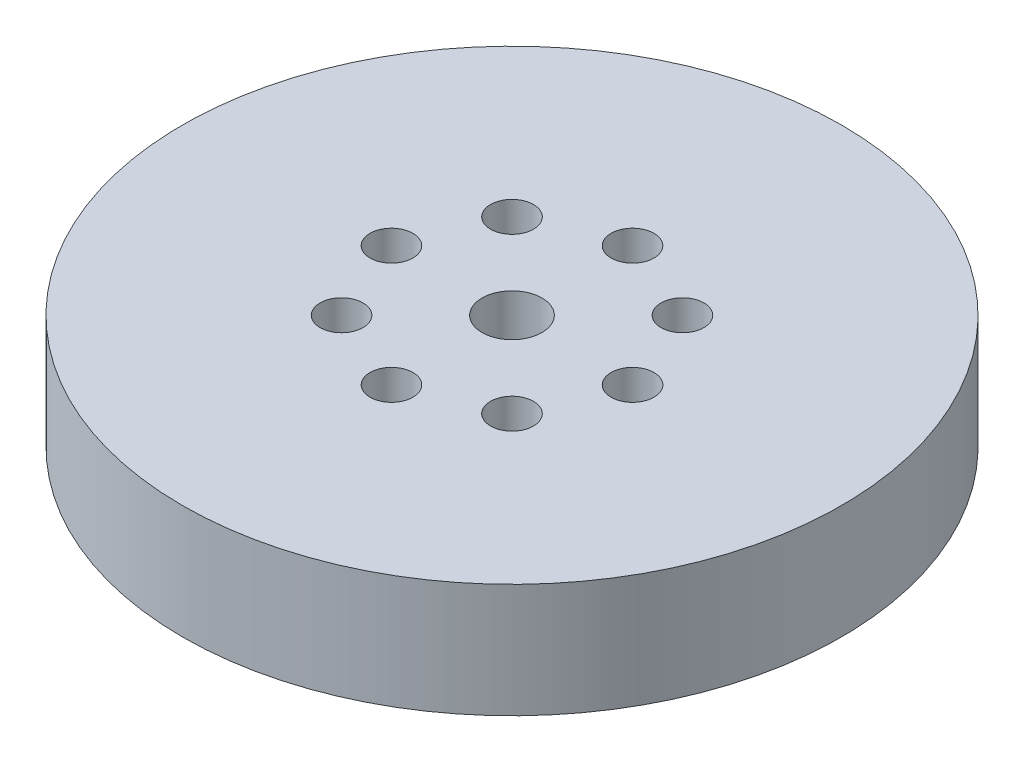
ISO-10303-21;
HEADER;
FILE_DESCRIPTION(('STEP AP214'),'2;1');
FILE_NAME('part.step','',(''),(''),'','','');
FILE_SCHEMA(('AUTOMOTIVE_DESIGN { 1 0 10303 214 1 1 1 1 }'));
ENDSEC;
DATA;
#1=APPLICATION_CONTEXT('core data for automotive mechanical design processes');
#2=APPLICATION_PROTOCOL_DEFINITION('international standard','automotive_design',2000,#1);
#3=PRODUCT_CONTEXT('',#1,'mechanical');
#4=PRODUCT('Part','Part','',(#3));
#5=PRODUCT_RELATED_PRODUCT_CATEGORY('part','',(#4));
#6=PRODUCT_DEFINITION_FORMATION('','',#4);
#7=PRODUCT_DEFINITION_CONTEXT('part definition',#1,'design');
#8=PRODUCT_DEFINITION('design','',#6,#7);
#9=PRODUCT_DEFINITION_SHAPE('','',#8);
#10=(LENGTH_UNIT() NAMED_UNIT(*) SI_UNIT(.MILLI.,.METRE.));
#11=(NAMED_UNIT(*) PLANE_ANGLE_UNIT() SI_UNIT($,.RADIAN.));
#12=(NAMED_UNIT(*) SI_UNIT($,.STERADIAN.) SOLID_ANGLE_UNIT());
#13=UNCERTAINTY_MEASURE_WITH_UNIT(LENGTH_MEASURE(1.E-05),#10,'distance_accuracy_value','');
#14=(GEOMETRIC_REPRESENTATION_CONTEXT(3) GLOBAL_UNCERTAINTY_ASSIGNED_CONTEXT((#13)) GLOBAL_UNIT_ASSIGNED_CONTEXT((#10,
#11,#12)) REPRESENTATION_CONTEXT('',''));
#15=CARTESIAN_POINT('',(0.,0.,0.));
#16=DIRECTION('',(0.,0.,1.));
#17=DIRECTION('',(1.,0.,0.));
#18=AXIS2_PLACEMENT_3D('',#15,#16,#17);
#19=CARTESIAN_POINT('',(0.,19.,0.));
#20=DIRECTION('',(0.,-1.,0.));
#21=DIRECTION('',(0.,0.,-1.));
#22=AXIS2_PLACEMENT_3D('',#19,#20,#21);
#23=CYLINDRICAL_SURFACE('',#22,55.);
#24=CARTESIAN_POINT('',(0.,19.,0.));
#25=DIRECTION('',(0.,1.,0.));
#26=DIRECTION('',(0.,0.,1.));
#27=AXIS2_PLACEMENT_3D('',#24,#25,#26);
#28=CIRCLE('',#27,55.);
#29=CARTESIAN_POINT('',(0.,19.,55.));
#30=VERTEX_POINT('',#29);
#31=EDGE_CURVE('E10',#30,#30,#28,.T.);
#32=ORIENTED_EDGE('',*,*,#31,.F.);
#33=EDGE_LOOP('',(#32));
#34=FACE_BOUND('',#33,.T.);
#35=CARTESIAN_POINT('',(0.,0.,0.));
#36=DIRECTION('',(0.,1.,0.));
#37=DIRECTION('',(0.,0.,1.));
#38=AXIS2_PLACEMENT_3D('',#35,#36,#37);
#39=CIRCLE('',#38,55.);
#40=CARTESIAN_POINT('',(0.,0.,55.));
#41=VERTEX_POINT('',#40);
#42=EDGE_CURVE('E37',#41,#41,#39,.T.);
#43=ORIENTED_EDGE('',*,*,#42,.T.);
#44=EDGE_LOOP('',(#43));
#45=FACE_BOUND('',#44,.T.);
#46=ADVANCED_FACE('F40',(#34,#45),#23,.T.);
#47=CARTESIAN_POINT('',(0.,19.,0.));
#48=DIRECTION('',(0.,1.,0.));
#49=DIRECTION('',(0.,0.,1.));
#50=AXIS2_PLACEMENT_3D('',#47,#48,#49);
#51=PLANE('',#50);
#52=CARTESIAN_POINT('',(0.,19.,20.1163164145949));
#53=DIRECTION('',(0.,1.,0.));
#54=DIRECTION('',(1.,0.,0.));
#55=AXIS2_PLACEMENT_3D('',#52,#53,#54);
#56=CIRCLE('',#55,3.57820653908378);
#57=CARTESIAN_POINT('',(3.57820653908385,19.,20.1163164145949));
#58=VERTEX_POINT('',#57);
#59=EDGE_CURVE('E88',#58,#58,#56,.T.);
#60=ORIENTED_EDGE('',*,*,#59,.F.);
#61=EDGE_LOOP('',(#60));
#62=FACE_BOUND('',#61,.T.);
#63=CARTESIAN_POINT('',(14.2243837492544,19.,14.2243837492542));
#64=DIRECTION('',(0.,1.,0.));
#65=DIRECTION('',(0.707106781186544,0.,-0.707106781186551));
#66=AXIS2_PLACEMENT_3D('',#63,#64,#65);
#67=CIRCLE('',#66,3.57820653908378);
#68=CARTESIAN_POINT('',(16.7545578575265,19.,11.694209640982));
#69=VERTEX_POINT('',#68);
#70=EDGE_CURVE('E79',#69,#69,#67,.T.);
#71=ORIENTED_EDGE('',*,*,#70,.F.);
#72=EDGE_LOOP('',(#71));
#73=FACE_BOUND('',#72,.T.);
#74=CARTESIAN_POINT('',(20.1163164145949,19.,0.));
#75=DIRECTION('',(0.,1.,0.));
#76=DIRECTION('',(0.,0.,-1.));
#77=AXIS2_PLACEMENT_3D('',#74,#75,#76);
#78=CIRCLE('',#77,3.57820653908378);
#79=CARTESIAN_POINT('',(20.1163164145949,19.,-3.57820653908378));
#80=VERTEX_POINT('',#79);
#81=EDGE_CURVE('E74',#80,#80,#78,.T.);
#82=ORIENTED_EDGE('',*,*,#81,.F.);
#83=EDGE_LOOP('',(#82));
#84=FACE_BOUND('',#83,.T.);
#85=CARTESIAN_POINT('',(14.2243837492542,19.,-14.2243837492544));
#86=DIRECTION('',(0.,1.,0.));
#87=DIRECTION('',(-0.707106781186554,0.,-0.707106781186541));
#88=AXIS2_PLACEMENT_3D('',#85,#86,#87);
#89=CIRCLE('',#88,3.57820653908378);
#90=CARTESIAN_POINT('',(11.694209640982,19.,-16.7545578575266));
#91=VERTEX_POINT('',#90);
#92=EDGE_CURVE('E70',#91,#91,#89,.T.);
#93=ORIENTED_EDGE('',*,*,#92,.F.);
#94=EDGE_LOOP('',(#93));
#95=FACE_BOUND('',#94,.T.);
#96=CARTESIAN_POINT('',(-2.10707230103466E-13,19.,-20.1163164145949));
#97=DIRECTION('',(0.,1.,0.));
#98=DIRECTION('',(-1.,0.,0.));
#99=AXIS2_PLACEMENT_3D('',#96,#97,#98);
#100=CIRCLE('',#99,3.57820653908378);
#101=CARTESIAN_POINT('',(-3.57820653908399,19.,-20.1163164145948));
#102=VERTEX_POINT('',#101);
#103=EDGE_CURVE('E100',#102,#102,#100,.T.);
#104=ORIENTED_EDGE('',*,*,#103,.F.);
#105=EDGE_LOOP('',(#104));
#106=FACE_BOUND('',#105,.T.);
#107=CARTESIAN_POINT('',(-14.2243837492545,19.,-14.2243837492541));
#108=DIRECTION('',(0.,1.,0.));
#109=DIRECTION('',(-0.707106781186539,0.,0.707106781186556));
#110=AXIS2_PLACEMENT_3D('',#107,#108,#109);
#111=CIRCLE('',#110,3.57820653908378);
#112=CARTESIAN_POINT('',(-16.7545578575266,19.,-11.6942096409819));
#113=VERTEX_POINT('',#112);
#114=EDGE_CURVE('E93',#113,#113,#111,.T.);
#115=ORIENTED_EDGE('',*,*,#114,.F.);
#116=EDGE_LOOP('',(#115));
#117=FACE_BOUND('',#116,.T.);
#118=CARTESIAN_POINT('',(-14.2243837492543,19.,14.2243837492543));
#119=DIRECTION('',(0.,1.,0.));
#120=DIRECTION('',(0.707106781186549,0.,0.707106781186546));
#121=AXIS2_PLACEMENT_3D('',#118,#119,#120);
#122=CIRCLE('',#121,3.57820653908378);
#123=CARTESIAN_POINT('',(-11.6942096409821,19.,16.7545578575265));
#124=VERTEX_POINT('',#123);
#125=EDGE_CURVE('E61',#124,#124,#122,.T.);
#126=ORIENTED_EDGE('',*,*,#125,.F.);
#127=EDGE_LOOP('',(#126));
#128=FACE_BOUND('',#127,.T.);
#129=CARTESIAN_POINT('',(-20.1163164145949,19.,0.));
#130=DIRECTION('',(0.,1.,0.));
#131=DIRECTION('',(0.,0.,1.));
#132=AXIS2_PLACEMENT_3D('',#129,#130,#131);
#133=CIRCLE('',#132,3.57820653908378);
#134=CARTESIAN_POINT('',(-20.1163164145949,19.,3.57820653908378));
#135=VERTEX_POINT('',#134);
#136=EDGE_CURVE('E54',#135,#135,#133,.T.);
#137=ORIENTED_EDGE('',*,*,#136,.F.);
#138=EDGE_LOOP('',(#137));
#139=FACE_BOUND('',#138,.T.);
#140=CARTESIAN_POINT('',(0.,19.,0.));
#141=DIRECTION('',(0.,1.,0.));
#142=DIRECTION('',(0.,0.,1.));
#143=AXIS2_PLACEMENT_3D('',#140,#141,#142);
#144=CIRCLE('',#143,5.);
#145=CARTESIAN_POINT('',(0.,19.,5.));
#146=VERTEX_POINT('',#145);
#147=EDGE_CURVE('E50',#146,#146,#144,.T.);
#148=ORIENTED_EDGE('',*,*,#147,.F.);
#149=EDGE_LOOP('',(#148));
#150=FACE_BOUND('',#149,.T.);
#151=ORIENTED_EDGE('',*,*,#31,.T.);
#152=EDGE_LOOP('',(#151));
#153=FACE_BOUND('',#152,.T.);
#154=ADVANCED_FACE('F115',(#62,#73,#84,#95,#106,#117,#128,#139,#150,#153),#51,.T.);
#155=CARTESIAN_POINT('',(0.,0.,0.));
#156=DIRECTION('',(0.,1.,0.));
#157=DIRECTION('',(0.,0.,1.));
#158=AXIS2_PLACEMENT_3D('',#155,#156,#157);
#159=PLANE('',#158);
#160=CARTESIAN_POINT('',(0.,0.,0.));
#161=DIRECTION('',(0.,1.,0.));
#162=DIRECTION('',(0.,0.,1.));
#163=AXIS2_PLACEMENT_3D('',#160,#161,#162);
#164=CIRCLE('',#163,5.);
#165=CARTESIAN_POINT('',(0.,0.,5.));
#166=VERTEX_POINT('',#165);
#167=EDGE_CURVE('E47',#166,#166,#164,.T.);
#168=ORIENTED_EDGE('',*,*,#167,.T.);
#169=EDGE_LOOP('',(#168));
#170=FACE_BOUND('',#169,.T.);
#171=ORIENTED_EDGE('',*,*,#42,.F.);
#172=EDGE_LOOP('',(#171));
#173=FACE_BOUND('',#172,.T.);
#174=ADVANCED_FACE('F113',(#170,#173),#159,.F.);
#175=CARTESIAN_POINT('',(0.,19.,0.));
#176=DIRECTION('',(0.,-1.,0.));
#177=DIRECTION('',(0.,0.,-1.));
#178=AXIS2_PLACEMENT_3D('',#175,#176,#177);
#179=CYLINDRICAL_SURFACE('',#178,5.);
#180=ORIENTED_EDGE('',*,*,#147,.T.);
#181=EDGE_LOOP('',(#180));
#182=FACE_BOUND('',#181,.T.);
#183=ORIENTED_EDGE('',*,*,#167,.F.);
#184=EDGE_LOOP('',(#183));
#185=FACE_BOUND('',#184,.T.);
#186=ADVANCED_FACE('F127',(#182,#185),#179,.F.);
#187=CARTESIAN_POINT('',(-20.1163164145949,0.740613970869972,0.));
#188=DIRECTION('',(0.,1.,0.));
#189=DIRECTION('',(0.,0.,1.));
#190=AXIS2_PLACEMENT_3D('',#187,#188,#189);
#191=CYLINDRICAL_SURFACE('',#190,3.57820653908378);
#192=CARTESIAN_POINT('',(-20.1163164145949,0.740613970869972,0.));
#193=DIRECTION('',(0.,1.,0.));
#194=DIRECTION('',(0.,0.,1.));
#195=AXIS2_PLACEMENT_3D('',#192,#193,#194);
#196=CIRCLE('',#195,3.57820653908378);
#197=CARTESIAN_POINT('',(-20.1163164145949,0.740613970869972,3.57820653908378));
#198=VERTEX_POINT('',#197);
#199=EDGE_CURVE('E55',#198,#198,#196,.T.);
#200=ORIENTED_EDGE('',*,*,#199,.F.);
#201=EDGE_LOOP('',(#200));
#202=FACE_BOUND('',#201,.T.);
#203=ORIENTED_EDGE('',*,*,#136,.T.);
#204=EDGE_LOOP('',(#203));
#205=FACE_BOUND('',#204,.T.);
#206=ADVANCED_FACE('F129',(#202,#205),#191,.F.);
#207=CARTESIAN_POINT('',(-20.1163164145949,0.740613970869972,0.));
#208=DIRECTION('',(0.,1.,0.));
#209=DIRECTION('',(0.,0.,1.));
#210=AXIS2_PLACEMENT_3D('',#207,#208,#209);
#211=PLANE('',#210);
#212=ORIENTED_EDGE('',*,*,#199,.T.);
#213=EDGE_LOOP('',(#212));
#214=FACE_BOUND('',#213,.T.);
#215=ADVANCED_FACE('F157',(#214),#211,.T.);
#216=CARTESIAN_POINT('',(-14.2243837492543,0.740613970869972,14.2243837492543));
#217=DIRECTION('',(0.,1.,0.));
#218=DIRECTION('',(0.,0.,1.));
#219=AXIS2_PLACEMENT_3D('',#216,#217,#218);
#220=CYLINDRICAL_SURFACE('',#219,3.57820653908378);
#221=CARTESIAN_POINT('',(-14.2243837492543,0.740613970869972,14.2243837492543));
#222=DIRECTION('',(0.,1.,0.));
#223=DIRECTION('',(0.707106781186549,0.,0.707106781186546));
#224=AXIS2_PLACEMENT_3D('',#221,#222,#223);
#225=CIRCLE('',#224,3.57820653908378);
#226=CARTESIAN_POINT('',(-11.6942096409821,0.740613970869972,16.7545578575265));
#227=VERTEX_POINT('',#226);
#228=EDGE_CURVE('E59',#227,#227,#225,.T.);
#229=ORIENTED_EDGE('',*,*,#228,.F.);
#230=EDGE_LOOP('',(#229));
#231=FACE_BOUND('',#230,.T.);
#232=ORIENTED_EDGE('',*,*,#125,.T.);
#233=EDGE_LOOP('',(#232));
#234=FACE_BOUND('',#233,.T.);
#235=ADVANCED_FACE('F170',(#231,#234),#220,.F.);
#236=CARTESIAN_POINT('',(-14.2243837492543,0.740613970869972,14.2243837492543));
#237=DIRECTION('',(0.,1.,0.));
#238=DIRECTION('',(0.707106781186549,0.,0.707106781186546));
#239=AXIS2_PLACEMENT_3D('',#236,#237,#238);
#240=PLANE('',#239);
#241=ORIENTED_EDGE('',*,*,#228,.T.);
#242=EDGE_LOOP('',(#241));
#243=FACE_BOUND('',#242,.T.);
#244=ADVANCED_FACE('F182',(#243),#240,.T.);
#245=CARTESIAN_POINT('',(-14.2243837492545,0.740613970869972,-14.2243837492541));
#246=DIRECTION('',(0.,1.,0.));
#247=DIRECTION('',(0.,0.,1.));
#248=AXIS2_PLACEMENT_3D('',#245,#246,#247);
#249=CYLINDRICAL_SURFACE('',#248,3.57820653908378);
#250=CARTESIAN_POINT('',(-14.2243837492545,0.740613970869972,-14.2243837492541));
#251=DIRECTION('',(0.,1.,0.));
#252=DIRECTION('',(-0.707106781186539,0.,0.707106781186556));
#253=AXIS2_PLACEMENT_3D('',#250,#251,#252);
#254=CIRCLE('',#253,3.57820653908378);
#255=CARTESIAN_POINT('',(-16.7545578575266,0.740613970869972,-11.6942096409819));
#256=VERTEX_POINT('',#255);
#257=EDGE_CURVE('E94',#256,#256,#254,.T.);
#258=ORIENTED_EDGE('',*,*,#257,.F.);
#259=EDGE_LOOP('',(#258));
#260=FACE_BOUND('',#259,.T.);
#261=ORIENTED_EDGE('',*,*,#114,.T.);
#262=EDGE_LOOP('',(#261));
#263=FACE_BOUND('',#262,.T.);
#264=ADVANCED_FACE('F189',(#260,#263),#249,.F.);
#265=CARTESIAN_POINT('',(-14.2243837492545,0.740613970869972,-14.2243837492541));
#266=DIRECTION('',(0.,1.,0.));
#267=DIRECTION('',(-0.707106781186539,0.,0.707106781186556));
#268=AXIS2_PLACEMENT_3D('',#265,#266,#267);
#269=PLANE('',#268);
#270=ORIENTED_EDGE('',*,*,#257,.T.);
#271=EDGE_LOOP('',(#270));
#272=FACE_BOUND('',#271,.T.);
#273=ADVANCED_FACE('F107',(#272),#269,.T.);
#274=CARTESIAN_POINT('',(-2.10707230103466E-13,0.740613970869972,-20.1163164145949));
#275=DIRECTION('',(0.,1.,0.));
#276=DIRECTION('',(0.,0.,1.));
#277=AXIS2_PLACEMENT_3D('',#274,#275,#276);
#278=CYLINDRICAL_SURFACE('',#277,3.57820653908378);
#279=CARTESIAN_POINT('',(-2.10707230103466E-13,0.740613970869972,-20.1163164145949));
#280=DIRECTION('',(0.,1.,0.));
#281=DIRECTION('',(-1.,0.,0.));
#282=AXIS2_PLACEMENT_3D('',#279,#280,#281);
#283=CIRCLE('',#282,3.57820653908378);
#284=CARTESIAN_POINT('',(-3.57820653908399,0.740613970869972,-20.1163164145948));
#285=VERTEX_POINT('',#284);
#286=EDGE_CURVE('E72',#285,#285,#283,.T.);
#287=ORIENTED_EDGE('',*,*,#286,.F.);
#288=EDGE_LOOP('',(#287));
#289=FACE_BOUND('',#288,.T.);
#290=ORIENTED_EDGE('',*,*,#103,.T.);
#291=EDGE_LOOP('',(#290));
#292=FACE_BOUND('',#291,.T.);
#293=ADVANCED_FACE('F104',(#289,#292),#278,.F.);
#294=CARTESIAN_POINT('',(-2.10707230103466E-13,0.740613970869972,-20.1163164145949));
#295=DIRECTION('',(0.,1.,0.));
#296=DIRECTION('',(-1.,0.,0.));
#297=AXIS2_PLACEMENT_3D('',#294,#295,#296);
#298=PLANE('',#297);
#299=ORIENTED_EDGE('',*,*,#286,.T.);
#300=EDGE_LOOP('',(#299));
#301=FACE_BOUND('',#300,.T.);
#302=ADVANCED_FACE('F103',(#301),#298,.T.);
#303=CARTESIAN_POINT('',(14.2243837492542,0.740613970869972,-14.2243837492544));
#304=DIRECTION('',(0.,1.,0.));
#305=DIRECTION('',(0.,0.,1.));
#306=AXIS2_PLACEMENT_3D('',#303,#304,#305);
#307=CYLINDRICAL_SURFACE('',#306,3.57820653908378);
#308=CARTESIAN_POINT('',(14.2243837492542,0.740613970869972,-14.2243837492544));
#309=DIRECTION('',(0.,1.,0.));
#310=DIRECTION('',(-0.707106781186554,0.,-0.707106781186541));
#311=AXIS2_PLACEMENT_3D('',#308,#309,#310);
#312=CIRCLE('',#311,3.57820653908378);
#313=CARTESIAN_POINT('',(11.694209640982,0.740613970869972,-16.7545578575266));
#314=VERTEX_POINT('',#313);
#315=EDGE_CURVE('E69',#314,#314,#312,.T.);
#316=ORIENTED_EDGE('',*,*,#315,.F.);
#317=EDGE_LOOP('',(#316));
#318=FACE_BOUND('',#317,.T.);
#319=ORIENTED_EDGE('',*,*,#92,.T.);
#320=EDGE_LOOP('',(#319));
#321=FACE_BOUND('',#320,.T.);
#322=ADVANCED_FACE('F219',(#318,#321),#307,.F.);
#323=CARTESIAN_POINT('',(14.2243837492542,0.740613970869972,-14.2243837492544));
#324=DIRECTION('',(0.,1.,0.));
#325=DIRECTION('',(-0.707106781186554,0.,-0.707106781186541));
#326=AXIS2_PLACEMENT_3D('',#323,#324,#325);
#327=PLANE('',#326);
#328=ORIENTED_EDGE('',*,*,#315,.T.);
#329=EDGE_LOOP('',(#328));
#330=FACE_BOUND('',#329,.T.);
#331=ADVANCED_FACE('F227',(#330),#327,.T.);
#332=CARTESIAN_POINT('',(20.1163164145949,0.740613970869972,0.));
#333=DIRECTION('',(0.,1.,0.));
#334=DIRECTION('',(0.,0.,1.));
#335=AXIS2_PLACEMENT_3D('',#332,#333,#334);
#336=CYLINDRICAL_SURFACE('',#335,3.57820653908378);
#337=CARTESIAN_POINT('',(20.1163164145949,0.740613970869972,0.));
#338=DIRECTION('',(0.,1.,0.));
#339=DIRECTION('',(0.,0.,-1.));
#340=AXIS2_PLACEMENT_3D('',#337,#338,#339);
#341=CIRCLE('',#340,3.57820653908378);
#342=CARTESIAN_POINT('',(20.1163164145949,0.740613970869972,-3.57820653908378));
#343=VERTEX_POINT('',#342);
#344=EDGE_CURVE('E80',#343,#343,#341,.T.);
#345=ORIENTED_EDGE('',*,*,#344,.F.);
#346=EDGE_LOOP('',(#345));
#347=FACE_BOUND('',#346,.T.);
#348=ORIENTED_EDGE('',*,*,#81,.T.);
#349=EDGE_LOOP('',(#348));
#350=FACE_BOUND('',#349,.T.);
#351=ADVANCED_FACE('F240',(#347,#350),#336,.F.);
#352=CARTESIAN_POINT('',(20.1163164145949,0.740613970869972,0.));
#353=DIRECTION('',(0.,1.,0.));
#354=DIRECTION('',(0.,0.,-1.));
#355=AXIS2_PLACEMENT_3D('',#352,#353,#354);
#356=PLANE('',#355);
#357=ORIENTED_EDGE('',*,*,#344,.T.);
#358=EDGE_LOOP('',(#357));
#359=FACE_BOUND('',#358,.T.);
#360=ADVANCED_FACE('F246',(#359),#356,.T.);
#361=CARTESIAN_POINT('',(14.2243837492544,0.740613970869972,14.2243837492542));
#362=DIRECTION('',(0.,1.,0.));
#363=DIRECTION('',(0.,0.,1.));
#364=AXIS2_PLACEMENT_3D('',#361,#362,#363);
#365=CYLINDRICAL_SURFACE('',#364,3.57820653908378);
#366=CARTESIAN_POINT('',(14.2243837492544,0.740613970869972,14.2243837492542));
#367=DIRECTION('',(0.,1.,0.));
#368=DIRECTION('',(0.707106781186544,0.,-0.707106781186551));
#369=AXIS2_PLACEMENT_3D('',#366,#367,#368);
#370=CIRCLE('',#369,3.57820653908378);
#371=CARTESIAN_POINT('',(16.7545578575265,0.740613970869972,11.694209640982));
#372=VERTEX_POINT('',#371);
#373=EDGE_CURVE('E82',#372,#372,#370,.T.);
#374=ORIENTED_EDGE('',*,*,#373,.F.);
#375=EDGE_LOOP('',(#374));
#376=FACE_BOUND('',#375,.T.);
#377=ORIENTED_EDGE('',*,*,#70,.T.);
#378=EDGE_LOOP('',(#377));
#379=FACE_BOUND('',#378,.T.);
#380=ADVANCED_FACE('F254',(#376,#379),#365,.F.);
#381=CARTESIAN_POINT('',(14.2243837492544,0.740613970869972,14.2243837492542));
#382=DIRECTION('',(0.,1.,0.));
#383=DIRECTION('',(0.707106781186544,0.,-0.707106781186551));
#384=AXIS2_PLACEMENT_3D('',#381,#382,#383);
#385=PLANE('',#384);
#386=ORIENTED_EDGE('',*,*,#373,.T.);
#387=EDGE_LOOP('',(#386));
#388=FACE_BOUND('',#387,.T.);
#389=ADVANCED_FACE('F262',(#388),#385,.T.);
#390=CARTESIAN_POINT('',(0.,0.740613970869972,20.1163164145949));
#391=DIRECTION('',(0.,1.,0.));
#392=DIRECTION('',(0.,0.,1.));
#393=AXIS2_PLACEMENT_3D('',#390,#391,#392);
#394=CYLINDRICAL_SURFACE('',#393,3.57820653908378);
#395=CARTESIAN_POINT('',(0.,0.740613970869972,20.1163164145949));
#396=DIRECTION('',(0.,1.,0.));
#397=DIRECTION('',(1.,0.,0.));
#398=AXIS2_PLACEMENT_3D('',#395,#396,#397);
#399=CIRCLE('',#398,3.57820653908378);
#400=CARTESIAN_POINT('',(3.57820653908385,0.740613970869972,20.1163164145949));
#401=VERTEX_POINT('',#400);
#402=EDGE_CURVE('E63',#401,#401,#399,.T.);
#403=ORIENTED_EDGE('',*,*,#402,.F.);
#404=EDGE_LOOP('',(#403));
#405=FACE_BOUND('',#404,.T.);
#406=ORIENTED_EDGE('',*,*,#59,.T.);
#407=EDGE_LOOP('',(#406));
#408=FACE_BOUND('',#407,.T.);
#409=ADVANCED_FACE('F272',(#405,#408),#394,.F.);
#410=CARTESIAN_POINT('',(0.,0.740613970869972,20.1163164145949));
#411=DIRECTION('',(0.,1.,0.));
#412=DIRECTION('',(1.,0.,0.));
#413=AXIS2_PLACEMENT_3D('',#410,#411,#412);
#414=PLANE('',#413);
#415=ORIENTED_EDGE('',*,*,#402,.T.);
#416=EDGE_LOOP('',(#415));
#417=FACE_BOUND('',#416,.T.);
#418=ADVANCED_FACE('F285',(#417),#414,.T.);
#419=CLOSED_SHELL('',(#46,#154,#174,#186,#206,#215,#235,#244,#264,#273,#293,#302,#322,#331,#351,
#360,#380,#389,#409,#418));
#420=MANIFOLD_SOLID_BREP('B2',#419);
#421=ADVANCED_BREP_SHAPE_REPRESENTATION('',(#18,#420),#14);
#422=SHAPE_DEFINITION_REPRESENTATION(#9,#421);
ENDSEC;
END-ISO-10303-21;
